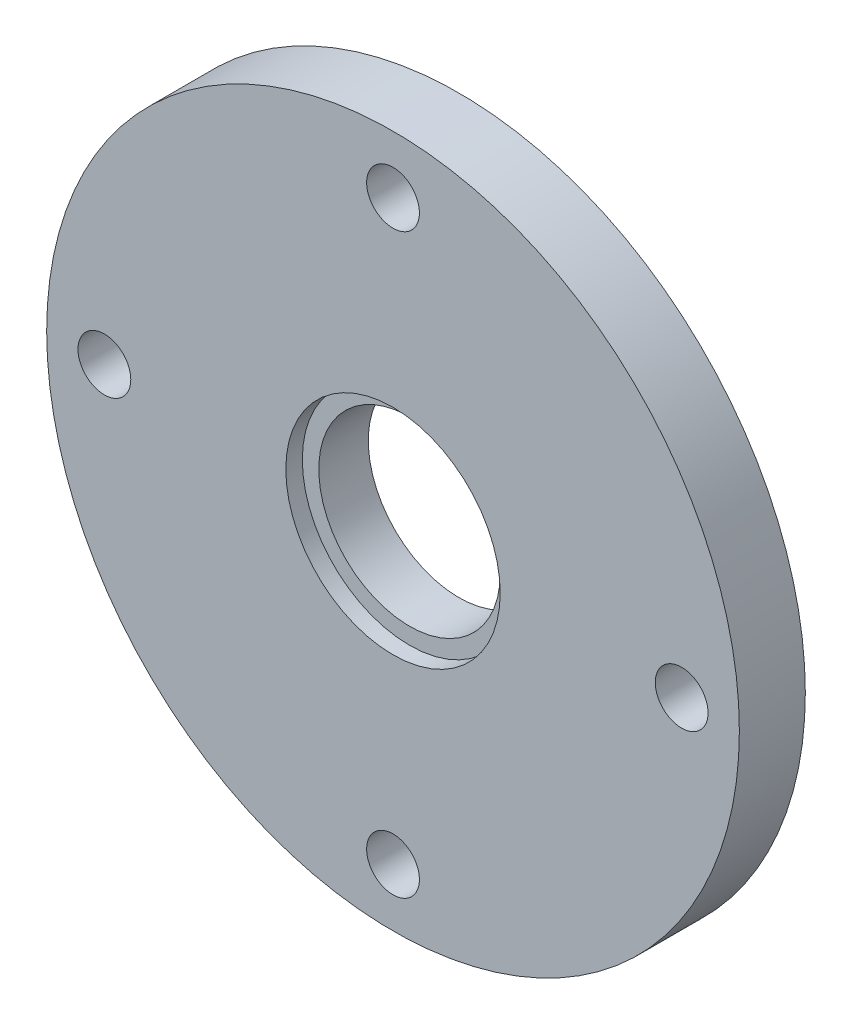
ISO-10303-21;
HEADER;
FILE_DESCRIPTION(('STEP AP214'),'2;1');
FILE_NAME('part.step','',(''),(''),'','','');
FILE_SCHEMA(('AUTOMOTIVE_DESIGN { 1 0 10303 214 1 1 1 1 }'));
ENDSEC;
DATA;
#1=APPLICATION_CONTEXT('core data for automotive mechanical design processes');
#2=APPLICATION_PROTOCOL_DEFINITION('international standard','automotive_design',2000,#1);
#3=PRODUCT_CONTEXT('',#1,'mechanical');
#4=PRODUCT('Part','Part','',(#3));
#5=PRODUCT_RELATED_PRODUCT_CATEGORY('part','',(#4));
#6=PRODUCT_DEFINITION_FORMATION('','',#4);
#7=PRODUCT_DEFINITION_CONTEXT('part definition',#1,'design');
#8=PRODUCT_DEFINITION('design','',#6,#7);
#9=PRODUCT_DEFINITION_SHAPE('','',#8);
#10=(LENGTH_UNIT() NAMED_UNIT(*) SI_UNIT(.MILLI.,.METRE.));
#11=(NAMED_UNIT(*) PLANE_ANGLE_UNIT() SI_UNIT($,.RADIAN.));
#12=(NAMED_UNIT(*) SI_UNIT($,.STERADIAN.) SOLID_ANGLE_UNIT());
#13=UNCERTAINTY_MEASURE_WITH_UNIT(LENGTH_MEASURE(1.E-05),#10,'distance_accuracy_value','');
#14=(GEOMETRIC_REPRESENTATION_CONTEXT(3) GLOBAL_UNCERTAINTY_ASSIGNED_CONTEXT((#13)) GLOBAL_UNIT_ASSIGNED_CONTEXT((#10,
#11,#12)) REPRESENTATION_CONTEXT('',''));
#15=CARTESIAN_POINT('',(0.,0.,0.));
#16=DIRECTION('',(0.,0.,1.));
#17=DIRECTION('',(1.,0.,0.));
#18=AXIS2_PLACEMENT_3D('',#15,#16,#17);
#19=CARTESIAN_POINT('',(-17.5,0.,4.));
#20=DIRECTION('',(0.,0.,-1.));
#21=DIRECTION('',(-1.,0.,0.));
#22=AXIS2_PLACEMENT_3D('',#19,#20,#21);
#23=CYLINDRICAL_SURFACE('',#22,1.6);
#24=CARTESIAN_POINT('',(-17.5,0.,4.));
#25=DIRECTION('',(0.,0.,1.));
#26=DIRECTION('',(1.,0.,0.));
#27=AXIS2_PLACEMENT_3D('',#24,#25,#26);
#28=CIRCLE('',#27,1.6);
#29=CARTESIAN_POINT('',(-15.9,0.,4.));
#30=VERTEX_POINT('',#29);
#31=EDGE_CURVE('E58',#30,#30,#28,.T.);
#32=ORIENTED_EDGE('',*,*,#31,.T.);
#33=EDGE_LOOP('',(#32));
#34=FACE_BOUND('',#33,.T.);
#35=CARTESIAN_POINT('',(-17.5,0.,1.55));
#36=DIRECTION('',(0.,0.,-1.));
#37=DIRECTION('',(-1.,0.,0.));
#38=AXIS2_PLACEMENT_3D('',#35,#36,#37);
#39=CIRCLE('',#38,1.6);
#40=CARTESIAN_POINT('',(-19.1,0.,1.55));
#41=VERTEX_POINT('',#40);
#42=EDGE_CURVE('E85',#41,#41,#39,.T.);
#43=ORIENTED_EDGE('',*,*,#42,.T.);
#44=EDGE_LOOP('',(#43));
#45=FACE_BOUND('',#44,.T.);
#46=ADVANCED_FACE('F32',(#34,#45),#23,.F.);
#47=CARTESIAN_POINT('',(0.,17.5,4.));
#48=DIRECTION('',(0.,0.,-1.));
#49=DIRECTION('',(-1.,0.,0.));
#50=AXIS2_PLACEMENT_3D('',#47,#48,#49);
#51=CYLINDRICAL_SURFACE('',#50,1.6);
#52=CARTESIAN_POINT('',(0.,17.5,4.));
#53=DIRECTION('',(0.,0.,1.));
#54=DIRECTION('',(1.,0.,0.));
#55=AXIS2_PLACEMENT_3D('',#52,#53,#54);
#56=CIRCLE('',#55,1.6);
#57=CARTESIAN_POINT('',(1.6,17.5,4.));
#58=VERTEX_POINT('',#57);
#59=EDGE_CURVE('E45',#58,#58,#56,.T.);
#60=ORIENTED_EDGE('',*,*,#59,.T.);
#61=EDGE_LOOP('',(#60));
#62=FACE_BOUND('',#61,.T.);
#63=CARTESIAN_POINT('',(0.,17.5,1.55));
#64=DIRECTION('',(0.,0.,-1.));
#65=DIRECTION('',(-1.,0.,0.));
#66=AXIS2_PLACEMENT_3D('',#63,#64,#65);
#67=CIRCLE('',#66,1.6);
#68=CARTESIAN_POINT('',(-1.6,17.5,1.55));
#69=VERTEX_POINT('',#68);
#70=EDGE_CURVE('E79',#69,#69,#67,.T.);
#71=ORIENTED_EDGE('',*,*,#70,.T.);
#72=EDGE_LOOP('',(#71));
#73=FACE_BOUND('',#72,.T.);
#74=ADVANCED_FACE('F142',(#62,#73),#51,.F.);
#75=CARTESIAN_POINT('',(17.5,0.,4.));
#76=DIRECTION('',(0.,0.,-1.));
#77=DIRECTION('',(-1.,0.,0.));
#78=AXIS2_PLACEMENT_3D('',#75,#76,#77);
#79=CYLINDRICAL_SURFACE('',#78,1.6);
#80=CARTESIAN_POINT('',(17.5,0.,4.));
#81=DIRECTION('',(0.,0.,1.));
#82=DIRECTION('',(1.,0.,0.));
#83=AXIS2_PLACEMENT_3D('',#80,#81,#82);
#84=CIRCLE('',#83,1.6);
#85=CARTESIAN_POINT('',(19.1,0.,4.));
#86=VERTEX_POINT('',#85);
#87=EDGE_CURVE('E52',#86,#86,#84,.T.);
#88=ORIENTED_EDGE('',*,*,#87,.T.);
#89=EDGE_LOOP('',(#88));
#90=FACE_BOUND('',#89,.T.);
#91=CARTESIAN_POINT('',(17.5,0.,1.55));
#92=DIRECTION('',(0.,0.,-1.));
#93=DIRECTION('',(-1.,0.,0.));
#94=AXIS2_PLACEMENT_3D('',#91,#92,#93);
#95=CIRCLE('',#94,1.6);
#96=CARTESIAN_POINT('',(15.9,0.,1.55));
#97=VERTEX_POINT('',#96);
#98=EDGE_CURVE('E73',#97,#97,#95,.T.);
#99=ORIENTED_EDGE('',*,*,#98,.T.);
#100=EDGE_LOOP('',(#99));
#101=FACE_BOUND('',#100,.T.);
#102=ADVANCED_FACE('F164',(#90,#101),#79,.F.);
#103=CARTESIAN_POINT('',(0.,-17.5,4.));
#104=DIRECTION('',(0.,0.,-1.));
#105=DIRECTION('',(-1.,0.,0.));
#106=AXIS2_PLACEMENT_3D('',#103,#104,#105);
#107=CYLINDRICAL_SURFACE('',#106,1.6);
#108=CARTESIAN_POINT('',(0.,-17.5,4.));
#109=DIRECTION('',(0.,0.,1.));
#110=DIRECTION('',(1.,0.,0.));
#111=AXIS2_PLACEMENT_3D('',#108,#109,#110);
#112=CIRCLE('',#111,1.6);
#113=CARTESIAN_POINT('',(1.60000000000001,-17.5,4.));
#114=VERTEX_POINT('',#113);
#115=EDGE_CURVE('E55',#114,#114,#112,.T.);
#116=ORIENTED_EDGE('',*,*,#115,.T.);
#117=EDGE_LOOP('',(#116));
#118=FACE_BOUND('',#117,.T.);
#119=CARTESIAN_POINT('',(0.,-17.5,1.55));
#120=DIRECTION('',(0.,0.,-1.));
#121=DIRECTION('',(-1.,0.,0.));
#122=AXIS2_PLACEMENT_3D('',#119,#120,#121);
#123=CIRCLE('',#122,1.6);
#124=CARTESIAN_POINT('',(-1.59999999999999,-17.5,1.55));
#125=VERTEX_POINT('',#124);
#126=EDGE_CURVE('E65',#125,#125,#123,.T.);
#127=ORIENTED_EDGE('',*,*,#126,.T.);
#128=EDGE_LOOP('',(#127));
#129=FACE_BOUND('',#128,.T.);
#130=ADVANCED_FACE('F111',(#118,#129),#107,.F.);
#131=CARTESIAN_POINT('',(0.,0.,4.));
#132=DIRECTION('',(0.,0.,-1.));
#133=DIRECTION('',(-1.,0.,0.));
#134=AXIS2_PLACEMENT_3D('',#131,#132,#133);
#135=CYLINDRICAL_SURFACE('',#134,5.5);
#136=CARTESIAN_POINT('',(0.,0.,0.));
#137=DIRECTION('',(0.,0.,1.));
#138=DIRECTION('',(1.,0.,0.));
#139=AXIS2_PLACEMENT_3D('',#136,#137,#138);
#140=CIRCLE('',#139,5.5);
#141=CARTESIAN_POINT('',(5.5,0.,0.));
#142=VERTEX_POINT('',#141);
#143=EDGE_CURVE('E49',#142,#142,#140,.T.);
#144=ORIENTED_EDGE('',*,*,#143,.F.);
#145=EDGE_LOOP('',(#144));
#146=FACE_BOUND('',#145,.T.);
#147=CARTESIAN_POINT('',(0.,0.,3.));
#148=DIRECTION('',(0.,0.,1.));
#149=DIRECTION('',(1.,0.,0.));
#150=AXIS2_PLACEMENT_3D('',#147,#148,#149);
#151=CIRCLE('',#150,5.5);
#152=CARTESIAN_POINT('',(5.5,0.,3.));
#153=VERTEX_POINT('',#152);
#154=EDGE_CURVE('E36',#153,#153,#151,.T.);
#155=ORIENTED_EDGE('',*,*,#154,.T.);
#156=EDGE_LOOP('',(#155));
#157=FACE_BOUND('',#156,.T.);
#158=ADVANCED_FACE('F108',(#146,#157),#135,.F.);
#159=CARTESIAN_POINT('',(0.,0.,4.));
#160=DIRECTION('',(0.,0.,1.));
#161=DIRECTION('',(1.,0.,0.));
#162=AXIS2_PLACEMENT_3D('',#159,#160,#161);
#163=PLANE('',#162);
#164=CARTESIAN_POINT('',(0.,0.,4.));
#165=DIRECTION('',(0.,0.,1.));
#166=DIRECTION('',(1.,0.,0.));
#167=AXIS2_PLACEMENT_3D('',#164,#165,#166);
#168=CIRCLE('',#167,6.5);
#169=CARTESIAN_POINT('',(6.5,0.,4.));
#170=VERTEX_POINT('',#169);
#171=EDGE_CURVE('E61',#170,#170,#168,.T.);
#172=ORIENTED_EDGE('',*,*,#171,.F.);
#173=EDGE_LOOP('',(#172));
#174=FACE_BOUND('',#173,.T.);
#175=ORIENTED_EDGE('',*,*,#115,.F.);
#176=EDGE_LOOP('',(#175));
#177=FACE_BOUND('',#176,.T.);
#178=CARTESIAN_POINT('',(0.,0.,4.));
#179=DIRECTION('',(0.,0.,1.));
#180=DIRECTION('',(1.,0.,0.));
#181=AXIS2_PLACEMENT_3D('',#178,#179,#180);
#182=CIRCLE('',#181,21.);
#183=CARTESIAN_POINT('',(21.,0.,4.));
#184=VERTEX_POINT('',#183);
#185=EDGE_CURVE('E10',#184,#184,#182,.T.);
#186=ORIENTED_EDGE('',*,*,#185,.T.);
#187=EDGE_LOOP('',(#186));
#188=FACE_BOUND('',#187,.T.);
#189=ORIENTED_EDGE('',*,*,#59,.F.);
#190=EDGE_LOOP('',(#189));
#191=FACE_BOUND('',#190,.T.);
#192=ORIENTED_EDGE('',*,*,#87,.F.);
#193=EDGE_LOOP('',(#192));
#194=FACE_BOUND('',#193,.T.);
#195=ORIENTED_EDGE('',*,*,#31,.F.);
#196=EDGE_LOOP('',(#195));
#197=FACE_BOUND('',#196,.T.);
#198=ADVANCED_FACE('F97',(#174,#177,#188,#191,#194,#197),#163,.T.);
#199=CARTESIAN_POINT('',(0.,0.,0.));
#200=DIRECTION('',(0.,0.,1.));
#201=DIRECTION('',(1.,0.,0.));
#202=AXIS2_PLACEMENT_3D('',#199,#200,#201);
#203=PLANE('',#202);
#204=CARTESIAN_POINT('',(-17.5,0.,0.));
#205=DIRECTION('',(0.,0.,-1.));
#206=DIRECTION('',(-1.,0.,0.));
#207=AXIS2_PLACEMENT_3D('',#204,#205,#206);
#208=CIRCLE('',#207,3.15);
#209=CARTESIAN_POINT('',(-20.65,0.,0.));
#210=VERTEX_POINT('',#209);
#211=EDGE_CURVE('E88',#210,#210,#208,.T.);
#212=ORIENTED_EDGE('',*,*,#211,.F.);
#213=EDGE_LOOP('',(#212));
#214=FACE_BOUND('',#213,.T.);
#215=CARTESIAN_POINT('',(0.,17.5,0.));
#216=DIRECTION('',(0.,0.,-1.));
#217=DIRECTION('',(-1.,0.,0.));
#218=AXIS2_PLACEMENT_3D('',#215,#216,#217);
#219=CIRCLE('',#218,3.15);
#220=CARTESIAN_POINT('',(-3.15,17.5,0.));
#221=VERTEX_POINT('',#220);
#222=EDGE_CURVE('E82',#221,#221,#219,.T.);
#223=ORIENTED_EDGE('',*,*,#222,.F.);
#224=EDGE_LOOP('',(#223));
#225=FACE_BOUND('',#224,.T.);
#226=CARTESIAN_POINT('',(17.5,0.,0.));
#227=DIRECTION('',(0.,0.,-1.));
#228=DIRECTION('',(-1.,0.,0.));
#229=AXIS2_PLACEMENT_3D('',#226,#227,#228);
#230=CIRCLE('',#229,3.15);
#231=CARTESIAN_POINT('',(14.35,0.,0.));
#232=VERTEX_POINT('',#231);
#233=EDGE_CURVE('E76',#232,#232,#230,.T.);
#234=ORIENTED_EDGE('',*,*,#233,.F.);
#235=EDGE_LOOP('',(#234));
#236=FACE_BOUND('',#235,.T.);
#237=CARTESIAN_POINT('',(0.,-17.5,0.));
#238=DIRECTION('',(0.,0.,-1.));
#239=DIRECTION('',(-1.,0.,0.));
#240=AXIS2_PLACEMENT_3D('',#237,#238,#239);
#241=CIRCLE('',#240,3.15);
#242=CARTESIAN_POINT('',(-3.15,-17.5,0.));
#243=VERTEX_POINT('',#242);
#244=EDGE_CURVE('E70',#243,#243,#241,.T.);
#245=ORIENTED_EDGE('',*,*,#244,.F.);
#246=EDGE_LOOP('',(#245));
#247=FACE_BOUND('',#246,.T.);
#248=CARTESIAN_POINT('',(0.,0.,0.));
#249=DIRECTION('',(0.,0.,1.));
#250=DIRECTION('',(1.,0.,0.));
#251=AXIS2_PLACEMENT_3D('',#248,#249,#250);
#252=CIRCLE('',#251,21.);
#253=CARTESIAN_POINT('',(21.,0.,0.));
#254=VERTEX_POINT('',#253);
#255=EDGE_CURVE('E40',#254,#254,#252,.T.);
#256=ORIENTED_EDGE('',*,*,#255,.F.);
#257=EDGE_LOOP('',(#256));
#258=FACE_BOUND('',#257,.T.);
#259=ORIENTED_EDGE('',*,*,#143,.T.);
#260=EDGE_LOOP('',(#259));
#261=FACE_BOUND('',#260,.T.);
#262=ADVANCED_FACE('F94',(#214,#225,#236,#247,#258,#261),#203,.F.);
#263=CARTESIAN_POINT('',(0.,0.,4.));
#264=DIRECTION('',(0.,0.,-1.));
#265=DIRECTION('',(-1.,0.,0.));
#266=AXIS2_PLACEMENT_3D('',#263,#264,#265);
#267=CYLINDRICAL_SURFACE('',#266,21.);
#268=ORIENTED_EDGE('',*,*,#185,.F.);
#269=EDGE_LOOP('',(#268));
#270=FACE_BOUND('',#269,.T.);
#271=ORIENTED_EDGE('',*,*,#255,.T.);
#272=EDGE_LOOP('',(#271));
#273=FACE_BOUND('',#272,.T.);
#274=ADVANCED_FACE('F34',(#270,#273),#267,.T.);
#275=CARTESIAN_POINT('',(0.,0.,3.));
#276=DIRECTION('',(0.,0.,1.));
#277=DIRECTION('',(1.,0.,0.));
#278=AXIS2_PLACEMENT_3D('',#275,#276,#277);
#279=CYLINDRICAL_SURFACE('',#278,6.5);
#280=CARTESIAN_POINT('',(0.,0.,3.));
#281=DIRECTION('',(0.,0.,1.));
#282=DIRECTION('',(1.,0.,0.));
#283=AXIS2_PLACEMENT_3D('',#280,#281,#282);
#284=CIRCLE('',#283,6.5);
#285=CARTESIAN_POINT('',(6.5,0.,3.));
#286=VERTEX_POINT('',#285);
#287=EDGE_CURVE('E64',#286,#286,#284,.T.);
#288=ORIENTED_EDGE('',*,*,#287,.F.);
#289=EDGE_LOOP('',(#288));
#290=FACE_BOUND('',#289,.T.);
#291=ORIENTED_EDGE('',*,*,#171,.T.);
#292=EDGE_LOOP('',(#291));
#293=FACE_BOUND('',#292,.T.);
#294=ADVANCED_FACE('F120',(#290,#293),#279,.F.);
#295=CARTESIAN_POINT('',(0.,0.,3.));
#296=DIRECTION('',(0.,0.,1.));
#297=DIRECTION('',(1.,0.,0.));
#298=AXIS2_PLACEMENT_3D('',#295,#296,#297);
#299=PLANE('',#298);
#300=ORIENTED_EDGE('',*,*,#154,.F.);
#301=EDGE_LOOP('',(#300));
#302=FACE_BOUND('',#301,.T.);
#303=ORIENTED_EDGE('',*,*,#287,.T.);
#304=EDGE_LOOP('',(#303));
#305=FACE_BOUND('',#304,.T.);
#306=ADVANCED_FACE('F116',(#302,#305),#299,.T.);
#307=CARTESIAN_POINT('',(0.,-17.5,0.));
#308=DIRECTION('',(0.,0.,-1.));
#309=DIRECTION('',(-1.,0.,0.));
#310=AXIS2_PLACEMENT_3D('',#307,#308,#309);
#311=CONICAL_SURFACE('',#310,3.15,0.785398163397448);
#312=ORIENTED_EDGE('',*,*,#126,.F.);
#313=EDGE_LOOP('',(#312));
#314=FACE_BOUND('',#313,.T.);
#315=ORIENTED_EDGE('',*,*,#244,.T.);
#316=EDGE_LOOP('',(#315));
#317=FACE_BOUND('',#316,.T.);
#318=ADVANCED_FACE('F119',(#314,#317),#311,.F.);
#319=CARTESIAN_POINT('',(17.5,0.,0.));
#320=DIRECTION('',(0.,0.,-1.));
#321=DIRECTION('',(-1.,0.,0.));
#322=AXIS2_PLACEMENT_3D('',#319,#320,#321);
#323=CONICAL_SURFACE('',#322,3.15,0.785398163397448);
#324=ORIENTED_EDGE('',*,*,#98,.F.);
#325=EDGE_LOOP('',(#324));
#326=FACE_BOUND('',#325,.T.);
#327=ORIENTED_EDGE('',*,*,#233,.T.);
#328=EDGE_LOOP('',(#327));
#329=FACE_BOUND('',#328,.T.);
#330=ADVANCED_FACE('F152',(#326,#329),#323,.F.);
#331=CARTESIAN_POINT('',(0.,17.5,0.));
#332=DIRECTION('',(0.,0.,-1.));
#333=DIRECTION('',(-1.,0.,0.));
#334=AXIS2_PLACEMENT_3D('',#331,#332,#333);
#335=CONICAL_SURFACE('',#334,3.15,0.785398163397448);
#336=ORIENTED_EDGE('',*,*,#70,.F.);
#337=EDGE_LOOP('',(#336));
#338=FACE_BOUND('',#337,.T.);
#339=ORIENTED_EDGE('',*,*,#222,.T.);
#340=EDGE_LOOP('',(#339));
#341=FACE_BOUND('',#340,.T.);
#342=ADVANCED_FACE('F147',(#338,#341),#335,.F.);
#343=CARTESIAN_POINT('',(-17.5,0.,0.));
#344=DIRECTION('',(0.,0.,-1.));
#345=DIRECTION('',(-1.,0.,0.));
#346=AXIS2_PLACEMENT_3D('',#343,#344,#345);
#347=CONICAL_SURFACE('',#346,3.15,0.785398163397448);
#348=ORIENTED_EDGE('',*,*,#42,.F.);
#349=EDGE_LOOP('',(#348));
#350=FACE_BOUND('',#349,.T.);
#351=ORIENTED_EDGE('',*,*,#211,.T.);
#352=EDGE_LOOP('',(#351));
#353=FACE_BOUND('',#352,.T.);
#354=ADVANCED_FACE('F92',(#350,#353),#347,.F.);
#355=CLOSED_SHELL('',(#46,#74,#102,#130,#158,#198,#262,#274,#294,#306,#318,#330,#342,#354));
#356=MANIFOLD_SOLID_BREP('B2',#355);
#357=ADVANCED_BREP_SHAPE_REPRESENTATION('',(#18,#356),#14);
#358=SHAPE_DEFINITION_REPRESENTATION(#9,#357);
ENDSEC;
END-ISO-10303-21;
